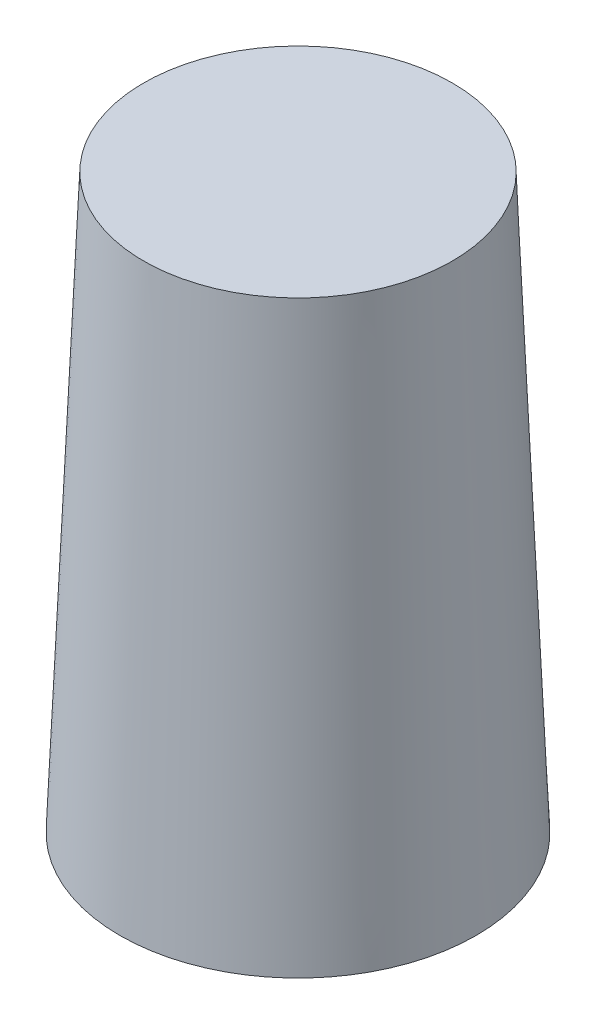
ISO-10303-21;
HEADER;
FILE_DESCRIPTION(('STEP AP214'),'2;1');
FILE_NAME('part.step','',(''),(''),'','','');
FILE_SCHEMA(('AUTOMOTIVE_DESIGN { 1 0 10303 214 1 1 1 1 }'));
ENDSEC;
DATA;
#1=APPLICATION_CONTEXT('core data for automotive mechanical design processes');
#2=APPLICATION_PROTOCOL_DEFINITION('international standard','automotive_design',2000,#1);
#3=PRODUCT_CONTEXT('',#1,'mechanical');
#4=PRODUCT('Part','Part','',(#3));
#5=PRODUCT_RELATED_PRODUCT_CATEGORY('part','',(#4));
#6=PRODUCT_DEFINITION_FORMATION('','',#4);
#7=PRODUCT_DEFINITION_CONTEXT('part definition',#1,'design');
#8=PRODUCT_DEFINITION('design','',#6,#7);
#9=PRODUCT_DEFINITION_SHAPE('','',#8);
#10=(LENGTH_UNIT() NAMED_UNIT(*) SI_UNIT(.MILLI.,.METRE.));
#11=(NAMED_UNIT(*) PLANE_ANGLE_UNIT() SI_UNIT($,.RADIAN.));
#12=(NAMED_UNIT(*) SI_UNIT($,.STERADIAN.) SOLID_ANGLE_UNIT());
#13=UNCERTAINTY_MEASURE_WITH_UNIT(LENGTH_MEASURE(1.E-05),#10,'distance_accuracy_value','');
#14=(GEOMETRIC_REPRESENTATION_CONTEXT(3) GLOBAL_UNCERTAINTY_ASSIGNED_CONTEXT((#13)) GLOBAL_UNIT_ASSIGNED_CONTEXT((#10,
#11,#12)) REPRESENTATION_CONTEXT('',''));
#15=CARTESIAN_POINT('',(0.,0.,0.));
#16=DIRECTION('',(0.,0.,1.));
#17=DIRECTION('',(1.,0.,0.));
#18=AXIS2_PLACEMENT_3D('',#15,#16,#17);
#19=CARTESIAN_POINT('',(47.449994,0.,0.));
#20=DIRECTION('',(0.,-1.,0.));
#21=DIRECTION('',(0.,0.,-1.));
#22=AXIS2_PLACEMENT_3D('',#19,#20,#21);
#23=PLANE('',#22);
#24=CARTESIAN_POINT('',(0.,0.,0.));
#25=DIRECTION('',(0.,-1.,0.));
#26=DIRECTION('',(0.,0.,-1.));
#27=AXIS2_PLACEMENT_3D('',#24,#25,#26);
#28=CIRCLE('',#27,47.449994);
#29=CARTESIAN_POINT('',(0.,0.,-47.449994));
#30=VERTEX_POINT('',#29);
#31=EDGE_CURVE('E47',#30,#30,#28,.T.);
#32=ORIENTED_EDGE('',*,*,#31,.T.);
#33=EDGE_LOOP('',(#32));
#34=FACE_BOUND('',#33,.T.);
#35=ADVANCED_FACE('F32',(#34),#23,.T.);
#36=CARTESIAN_POINT('',(0.,152.4,0.));
#37=DIRECTION('',(0.,1.,0.));
#38=DIRECTION('',(0.,0.,1.));
#39=AXIS2_PLACEMENT_3D('',#36,#37,#38);
#40=PLANE('',#39);
#41=CARTESIAN_POINT('',(0.,152.4,0.));
#42=DIRECTION('',(0.,-1.,0.));
#43=DIRECTION('',(0.,0.,-1.));
#44=AXIS2_PLACEMENT_3D('',#41,#42,#43);
#45=CIRCLE('',#44,41.099994);
#46=CARTESIAN_POINT('',(0.,152.4,-41.099994));
#47=VERTEX_POINT('',#46);
#48=EDGE_CURVE('E43',#47,#47,#45,.T.);
#49=ORIENTED_EDGE('',*,*,#48,.F.);
#50=EDGE_LOOP('',(#49));
#51=FACE_BOUND('',#50,.T.);
#52=ADVANCED_FACE('F56',(#51),#40,.T.);
#53=CARTESIAN_POINT('',(0.,0.,0.));
#54=DIRECTION('',(0.,-1.,0.));
#55=DIRECTION('',(0.,0.,-1.));
#56=AXIS2_PLACEMENT_3D('',#53,#54,#55);
#57=CONICAL_SURFACE('',#56,47.449994,0.0416425790985884);
#58=ORIENTED_EDGE('',*,*,#48,.T.);
#59=EDGE_LOOP('',(#58));
#60=FACE_BOUND('',#59,.T.);
#61=ORIENTED_EDGE('',*,*,#31,.F.);
#62=EDGE_LOOP('',(#61));
#63=FACE_BOUND('',#62,.T.);
#64=ADVANCED_FACE('F54',(#60,#63),#57,.T.);
#65=CLOSED_SHELL('',(#35,#52,#64));
#66=CARTESIAN_POINT('',(44.8019567616967,2.54,0.));
#67=DIRECTION('',(0.,1.,0.));
#68=DIRECTION('',(0.,0.,1.));
#69=AXIS2_PLACEMENT_3D('',#66,#67,#68);
#70=PLANE('',#69);
#71=CARTESIAN_POINT('',(0.,2.54,0.));
#72=DIRECTION('',(0.,-1.,0.));
#73=DIRECTION('',(0.,0.,-1.));
#74=AXIS2_PLACEMENT_3D('',#71,#72,#73);
#75=CIRCLE('',#74,44.8019567616967);
#76=CARTESIAN_POINT('',(0.,2.54,-44.8019567616967));
#77=VERTEX_POINT('',#76);
#78=EDGE_CURVE('E10',#77,#77,#75,.T.);
#79=ORIENTED_EDGE('',*,*,#78,.F.);
#80=EDGE_LOOP('',(#79));
#81=FACE_BOUND('',#80,.T.);
#82=ADVANCED_FACE('F82',(#81),#70,.T.);
#83=CARTESIAN_POINT('',(0.,149.86,0.));
#84=DIRECTION('',(0.,-1.,0.));
#85=DIRECTION('',(0.,0.,-1.));
#86=AXIS2_PLACEMENT_3D('',#83,#84,#85);
#87=CONICAL_SURFACE('',#86,38.6636234283634,0.0416425790985884);
#88=ORIENTED_EDGE('',*,*,#78,.T.);
#89=EDGE_LOOP('',(#88));
#90=FACE_BOUND('',#89,.T.);
#91=CARTESIAN_POINT('',(0.,149.86,0.));
#92=DIRECTION('',(0.,-1.,0.));
#93=DIRECTION('',(0.,0.,-1.));
#94=AXIS2_PLACEMENT_3D('',#91,#92,#93);
#95=CIRCLE('',#94,38.6636234283634);
#96=CARTESIAN_POINT('',(0.,149.86,-38.6636234283634));
#97=VERTEX_POINT('',#96);
#98=EDGE_CURVE('E39',#97,#97,#95,.T.);
#99=ORIENTED_EDGE('',*,*,#98,.F.);
#100=EDGE_LOOP('',(#99));
#101=FACE_BOUND('',#100,.T.);
#102=ADVANCED_FACE('F85',(#90,#101),#87,.F.);
#103=CARTESIAN_POINT('',(0.,149.86,0.));
#104=DIRECTION('',(0.,-1.,0.));
#105=DIRECTION('',(0.,0.,-1.));
#106=AXIS2_PLACEMENT_3D('',#103,#104,#105);
#107=PLANE('',#106);
#108=ORIENTED_EDGE('',*,*,#98,.T.);
#109=EDGE_LOOP('',(#108));
#110=FACE_BOUND('',#109,.T.);
#111=ADVANCED_FACE('F95',(#110),#107,.T.);
#112=CLOSED_SHELL('',(#82,#102,#111));
#113=ORIENTED_CLOSED_SHELL('',*,#112,.T.);
#114=BREP_WITH_VOIDS('B2',#65,(#113));
#115=ADVANCED_BREP_SHAPE_REPRESENTATION('',(#18,#114),#14);
#116=SHAPE_DEFINITION_REPRESENTATION(#9,#115);
ENDSEC;
END-ISO-10303-21;
